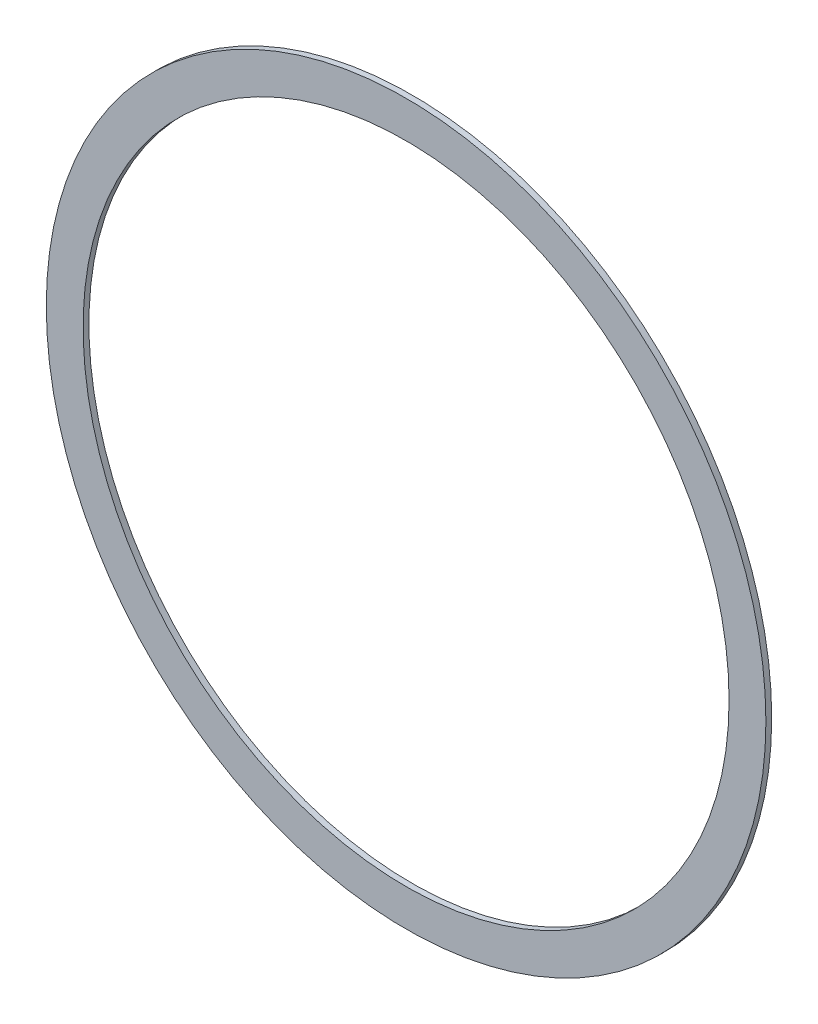
ISO-10303-21;
HEADER;
FILE_DESCRIPTION(('STEP AP214'),'2;1');
FILE_NAME('part.step','',(''),(''),'','','');
FILE_SCHEMA(('AUTOMOTIVE_DESIGN { 1 0 10303 214 1 1 1 1 }'));
ENDSEC;
DATA;
#1=APPLICATION_CONTEXT('core data for automotive mechanical design processes');
#2=APPLICATION_PROTOCOL_DEFINITION('international standard','automotive_design',2000,#1);
#3=PRODUCT_CONTEXT('',#1,'mechanical');
#4=PRODUCT('Part','Part','',(#3));
#5=PRODUCT_RELATED_PRODUCT_CATEGORY('part','',(#4));
#6=PRODUCT_DEFINITION_FORMATION('','',#4);
#7=PRODUCT_DEFINITION_CONTEXT('part definition',#1,'design');
#8=PRODUCT_DEFINITION('design','',#6,#7);
#9=PRODUCT_DEFINITION_SHAPE('','',#8);
#10=(LENGTH_UNIT() NAMED_UNIT(*) SI_UNIT(.MILLI.,.METRE.));
#11=(NAMED_UNIT(*) PLANE_ANGLE_UNIT() SI_UNIT($,.RADIAN.));
#12=(NAMED_UNIT(*) SI_UNIT($,.STERADIAN.) SOLID_ANGLE_UNIT());
#13=UNCERTAINTY_MEASURE_WITH_UNIT(LENGTH_MEASURE(1.E-05),#10,'distance_accuracy_value','');
#14=(GEOMETRIC_REPRESENTATION_CONTEXT(3) GLOBAL_UNCERTAINTY_ASSIGNED_CONTEXT((#13)) GLOBAL_UNIT_ASSIGNED_CONTEXT((#10,
#11,#12)) REPRESENTATION_CONTEXT('',''));
#15=CARTESIAN_POINT('',(0.,0.,0.));
#16=DIRECTION('',(0.,0.,1.));
#17=DIRECTION('',(1.,0.,0.));
#18=AXIS2_PLACEMENT_3D('',#15,#16,#17);
#19=CARTESIAN_POINT('',(0.,0.,2.25));
#20=DIRECTION('',(0.,0.,1.));
#21=DIRECTION('',(1.,0.,0.));
#22=AXIS2_PLACEMENT_3D('',#19,#20,#21);
#23=PLANE('',#22);
#24=CARTESIAN_POINT('',(0.,0.,2.25));
#25=DIRECTION('',(0.,0.,1.));
#26=DIRECTION('',(1.,0.,0.));
#27=AXIS2_PLACEMENT_3D('',#24,#25,#26);
#28=CIRCLE('',#27,278.5);
#29=CARTESIAN_POINT('',(278.5,0.,2.25));
#30=VERTEX_POINT('',#29);
#31=EDGE_CURVE('E10',#30,#30,#28,.T.);
#32=ORIENTED_EDGE('',*,*,#31,.T.);
#33=EDGE_LOOP('',(#32));
#34=FACE_BOUND('',#33,.T.);
#35=CARTESIAN_POINT('',(0.,0.,2.25));
#36=DIRECTION('',(0.,0.,1.));
#37=DIRECTION('',(1.,0.,0.));
#38=AXIS2_PLACEMENT_3D('',#35,#36,#37);
#39=CIRCLE('',#38,250.);
#40=CARTESIAN_POINT('',(250.,0.,2.25));
#41=VERTEX_POINT('',#40);
#42=EDGE_CURVE('E43',#41,#41,#39,.T.);
#43=ORIENTED_EDGE('',*,*,#42,.F.);
#44=EDGE_LOOP('',(#43));
#45=FACE_BOUND('',#44,.T.);
#46=ADVANCED_FACE('F32',(#34,#45),#23,.T.);
#47=CARTESIAN_POINT('',(0.,0.,-2.25));
#48=DIRECTION('',(0.,0.,1.));
#49=DIRECTION('',(1.,0.,0.));
#50=AXIS2_PLACEMENT_3D('',#47,#48,#49);
#51=PLANE('',#50);
#52=CARTESIAN_POINT('',(0.,0.,-2.25));
#53=DIRECTION('',(0.,0.,1.));
#54=DIRECTION('',(1.,0.,0.));
#55=AXIS2_PLACEMENT_3D('',#52,#53,#54);
#56=CIRCLE('',#55,278.5);
#57=CARTESIAN_POINT('',(278.5,0.,-2.25));
#58=VERTEX_POINT('',#57);
#59=EDGE_CURVE('E36',#58,#58,#56,.T.);
#60=ORIENTED_EDGE('',*,*,#59,.F.);
#61=EDGE_LOOP('',(#60));
#62=FACE_BOUND('',#61,.T.);
#63=CARTESIAN_POINT('',(0.,0.,-2.25));
#64=DIRECTION('',(0.,0.,1.));
#65=DIRECTION('',(1.,0.,0.));
#66=AXIS2_PLACEMENT_3D('',#63,#64,#65);
#67=CIRCLE('',#66,250.);
#68=CARTESIAN_POINT('',(250.,0.,-2.25));
#69=VERTEX_POINT('',#68);
#70=EDGE_CURVE('E45',#69,#69,#67,.T.);
#71=ORIENTED_EDGE('',*,*,#70,.T.);
#72=EDGE_LOOP('',(#71));
#73=FACE_BOUND('',#72,.T.);
#74=ADVANCED_FACE('F55',(#62,#73),#51,.F.);
#75=CARTESIAN_POINT('',(0.,0.,2.25));
#76=DIRECTION('',(0.,0.,-1.));
#77=DIRECTION('',(-1.,0.,0.));
#78=AXIS2_PLACEMENT_3D('',#75,#76,#77);
#79=CYLINDRICAL_SURFACE('',#78,278.5);
#80=ORIENTED_EDGE('',*,*,#31,.F.);
#81=EDGE_LOOP('',(#80));
#82=FACE_BOUND('',#81,.T.);
#83=ORIENTED_EDGE('',*,*,#59,.T.);
#84=EDGE_LOOP('',(#83));
#85=FACE_BOUND('',#84,.T.);
#86=ADVANCED_FACE('F34',(#82,#85),#79,.T.);
#87=CARTESIAN_POINT('',(0.,0.,2.25));
#88=DIRECTION('',(0.,0.,-1.));
#89=DIRECTION('',(-1.,0.,0.));
#90=AXIS2_PLACEMENT_3D('',#87,#88,#89);
#91=CYLINDRICAL_SURFACE('',#90,250.);
#92=ORIENTED_EDGE('',*,*,#42,.T.);
#93=EDGE_LOOP('',(#92));
#94=FACE_BOUND('',#93,.T.);
#95=ORIENTED_EDGE('',*,*,#70,.F.);
#96=EDGE_LOOP('',(#95));
#97=FACE_BOUND('',#96,.T.);
#98=ADVANCED_FACE('F51',(#94,#97),#91,.F.);
#99=CLOSED_SHELL('',(#46,#74,#86,#98));
#100=MANIFOLD_SOLID_BREP('B2',#99);
#101=ADVANCED_BREP_SHAPE_REPRESENTATION('',(#18,#100),#14);
#102=SHAPE_DEFINITION_REPRESENTATION(#9,#101);
ENDSEC;
END-ISO-10303-21;
